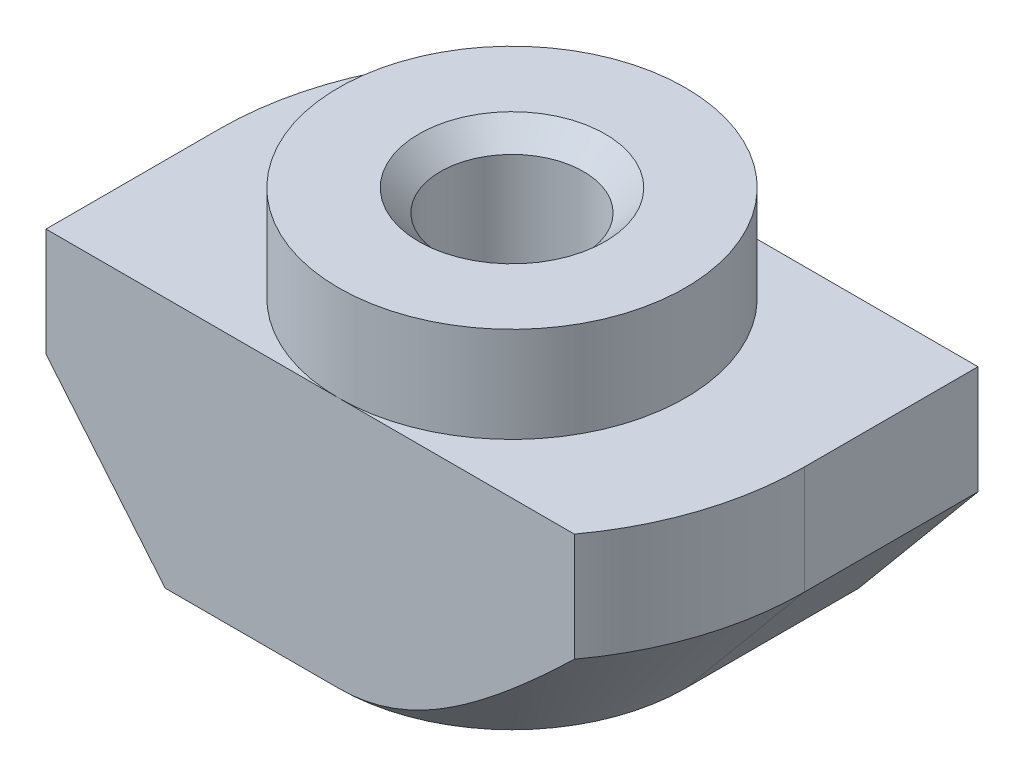
ISO-10303-21;
HEADER;
FILE_DESCRIPTION(('STEP AP214'),'2;1');
FILE_NAME('part.step','',(''),(''),'','','');
FILE_SCHEMA(('AUTOMOTIVE_DESIGN { 1 0 10303 214 1 1 1 1 }'));
ENDSEC;
DATA;
#1=APPLICATION_CONTEXT('core data for automotive mechanical design processes');
#2=APPLICATION_PROTOCOL_DEFINITION('international standard','automotive_design',2000,#1);
#3=PRODUCT_CONTEXT('',#1,'mechanical');
#4=PRODUCT('Part','Part','',(#3));
#5=PRODUCT_RELATED_PRODUCT_CATEGORY('part','',(#4));
#6=PRODUCT_DEFINITION_FORMATION('','',#4);
#7=PRODUCT_DEFINITION_CONTEXT('part definition',#1,'design');
#8=PRODUCT_DEFINITION('design','',#6,#7);
#9=PRODUCT_DEFINITION_SHAPE('','',#8);
#10=(LENGTH_UNIT() NAMED_UNIT(*) SI_UNIT(.MILLI.,.METRE.));
#11=(NAMED_UNIT(*) PLANE_ANGLE_UNIT() SI_UNIT($,.RADIAN.));
#12=(NAMED_UNIT(*) SI_UNIT($,.STERADIAN.) SOLID_ANGLE_UNIT());
#13=UNCERTAINTY_MEASURE_WITH_UNIT(LENGTH_MEASURE(1.E-05),#10,'distance_accuracy_value','');
#14=(GEOMETRIC_REPRESENTATION_CONTEXT(3) GLOBAL_UNCERTAINTY_ASSIGNED_CONTEXT((#13)) GLOBAL_UNIT_ASSIGNED_CONTEXT((#10,
#11,#12)) REPRESENTATION_CONTEXT('',''));
#15=CARTESIAN_POINT('',(0.,0.,0.));
#16=DIRECTION('',(0.,0.,1.));
#17=DIRECTION('',(1.,0.,0.));
#18=AXIS2_PLACEMENT_3D('',#15,#16,#17);
#19=CARTESIAN_POINT('',(-6.75,-2.2,4.));
#20=DIRECTION('',(1.,0.,0.));
#21=DIRECTION('',(0.,1.,0.));
#22=AXIS2_PLACEMENT_3D('',#19,#20,#21);
#23=PLANE('',#22);
#24=DIRECTION('',(0.,0.,-1.));
#25=VECTOR('',#24,1.);
#26=CARTESIAN_POINT('',(-6.75,-4.7,4.));
#27=LINE('',#26,#25);
#28=CARTESIAN_POINT('',(-6.75,-4.7,4.));
#29=VERTEX_POINT('',#28);
#30=CARTESIAN_POINT('',(-6.75,-4.7,0.));
#31=VERTEX_POINT('',#30);
#32=EDGE_CURVE('E205',#29,#31,#27,.T.);
#33=ORIENTED_EDGE('',*,*,#32,.F.);
#34=DIRECTION('',(0.,-1.,0.));
#35=VECTOR('',#34,1.);
#36=CARTESIAN_POINT('',(-6.75,-2.2,4.));
#37=LINE('',#36,#35);
#38=CARTESIAN_POINT('',(-6.75,-2.2,4.));
#39=VERTEX_POINT('',#38);
#40=EDGE_CURVE('E134',#39,#29,#37,.T.);
#41=ORIENTED_EDGE('',*,*,#40,.F.);
#42=DIRECTION('',(0.,0.,-1.));
#43=VECTOR('',#42,1.);
#44=CARTESIAN_POINT('',(-6.75,-2.2,4.));
#45=LINE('',#44,#43);
#46=CARTESIAN_POINT('',(-6.75,-2.2,0.));
#47=VERTEX_POINT('',#46);
#48=EDGE_CURVE('E12',#39,#47,#45,.T.);
#49=ORIENTED_EDGE('',*,*,#48,.T.);
#50=DIRECTION('',(0.,1.,0.));
#51=VECTOR('',#50,1.);
#52=CARTESIAN_POINT('',(-6.75,-8.,0.));
#53=LINE('',#52,#51);
#54=EDGE_CURVE('E206',#31,#47,#53,.T.);
#55=ORIENTED_EDGE('',*,*,#54,.F.);
#56=EDGE_LOOP('',(#33,#41,#49,#55));
#57=FACE_BOUND('',#56,.T.);
#58=ADVANCED_FACE('F38',(#57),#23,.F.);
#59=CARTESIAN_POINT('',(-6.75,-8.,4.));
#60=DIRECTION('',(0.,1.,0.));
#61=DIRECTION('',(0.,0.,1.));
#62=AXIS2_PLACEMENT_3D('',#59,#60,#61);
#63=PLANE('',#62);
#64=CARTESIAN_POINT('',(0.,-8.,0.));
#65=DIRECTION('',(0.,1.,0.));
#66=DIRECTION('',(0.,0.,1.));
#67=AXIS2_PLACEMENT_3D('',#64,#65,#66);
#68=CIRCLE('',#67,2.15);
#69=CARTESIAN_POINT('',(0.,-8.,2.15));
#70=VERTEX_POINT('',#69);
#71=EDGE_CURVE('E186',#70,#70,#68,.T.);
#72=ORIENTED_EDGE('',*,*,#71,.T.);
#73=EDGE_LOOP('',(#72));
#74=FACE_BOUND('',#73,.T.);
#75=DIRECTION('',(1.,0.,0.));
#76=VECTOR('',#75,1.);
#77=CARTESIAN_POINT('',(-6.75,-8.,4.));
#78=LINE('',#77,#76);
#79=CARTESIAN_POINT('',(-4.,-8.,4.));
#80=VERTEX_POINT('',#79);
#81=CARTESIAN_POINT('',(0.,-8.,4.));
#82=VERTEX_POINT('',#81);
#83=EDGE_CURVE('E132',#80,#82,#78,.T.);
#84=ORIENTED_EDGE('',*,*,#83,.F.);
#85=DIRECTION('',(0.,0.,-1.));
#86=VECTOR('',#85,1.);
#87=CARTESIAN_POINT('',(-4.,-8.,4.));
#88=LINE('',#87,#86);
#89=CARTESIAN_POINT('',(-4.,-8.,0.));
#90=VERTEX_POINT('',#89);
#91=EDGE_CURVE('E117',#80,#90,#88,.T.);
#92=ORIENTED_EDGE('',*,*,#91,.T.);
#93=CARTESIAN_POINT('',(0.,-8.,0.));
#94=DIRECTION('',(0.,-1.,0.));
#95=DIRECTION('',(-1.,0.,0.));
#96=AXIS2_PLACEMENT_3D('',#93,#94,#95);
#97=CIRCLE('',#96,4.);
#98=CARTESIAN_POINT('',(0.,-8.,-4.));
#99=VERTEX_POINT('',#98);
#100=EDGE_CURVE('E207',#90,#99,#97,.T.);
#101=ORIENTED_EDGE('',*,*,#100,.T.);
#102=DIRECTION('',(1.,0.,0.));
#103=VECTOR('',#102,1.);
#104=CARTESIAN_POINT('',(-6.75,-8.,-4.));
#105=LINE('',#104,#103);
#106=CARTESIAN_POINT('',(4.,-8.,-4.));
#107=VERTEX_POINT('',#106);
#108=EDGE_CURVE('E149',#99,#107,#105,.T.);
#109=ORIENTED_EDGE('',*,*,#108,.T.);
#110=DIRECTION('',(0.,0.,1.));
#111=VECTOR('',#110,1.);
#112=CARTESIAN_POINT('',(4.,-8.,-6.75));
#113=LINE('',#112,#111);
#114=CARTESIAN_POINT('',(4.,-8.,0.));
#115=VERTEX_POINT('',#114);
#116=EDGE_CURVE('E53',#107,#115,#113,.T.);
#117=ORIENTED_EDGE('',*,*,#116,.T.);
#118=CARTESIAN_POINT('',(0.,-8.,0.));
#119=DIRECTION('',(0.,-1.,0.));
#120=DIRECTION('',(1.,0.,0.));
#121=AXIS2_PLACEMENT_3D('',#118,#119,#120);
#122=CIRCLE('',#121,4.);
#123=EDGE_CURVE('E138',#115,#82,#122,.T.);
#124=ORIENTED_EDGE('',*,*,#123,.T.);
#125=EDGE_LOOP('',(#84,#92,#101,#109,#117,#124));
#126=FACE_BOUND('',#125,.T.);
#127=ADVANCED_FACE('F137',(#74,#126),#63,.F.);
#128=CARTESIAN_POINT('',(6.75,-2.2,4.));
#129=DIRECTION('',(-1.,0.,0.));
#130=DIRECTION('',(0.,-1.,0.));
#131=AXIS2_PLACEMENT_3D('',#128,#129,#130);
#132=PLANE('',#131);
#133=DIRECTION('',(0.,0.,1.));
#134=VECTOR('',#133,1.);
#135=CARTESIAN_POINT('',(6.75,-4.7,-6.75));
#136=LINE('',#135,#134);
#137=CARTESIAN_POINT('',(6.75,-4.7,-4.));
#138=VERTEX_POINT('',#137);
#139=CARTESIAN_POINT('',(6.75,-4.7,0.));
#140=VERTEX_POINT('',#139);
#141=EDGE_CURVE('E418',#138,#140,#136,.T.);
#142=ORIENTED_EDGE('',*,*,#141,.F.);
#143=DIRECTION('',(0.,1.,0.));
#144=VECTOR('',#143,1.);
#145=CARTESIAN_POINT('',(6.75,-2.2,-4.));
#146=LINE('',#145,#144);
#147=CARTESIAN_POINT('',(6.75,-2.2,-4.));
#148=VERTEX_POINT('',#147);
#149=EDGE_CURVE('E153',#138,#148,#146,.T.);
#150=ORIENTED_EDGE('',*,*,#149,.T.);
#151=DIRECTION('',(0.,0.,-1.));
#152=VECTOR('',#151,1.);
#153=CARTESIAN_POINT('',(6.75,-2.2,4.));
#154=LINE('',#153,#152);
#155=CARTESIAN_POINT('',(6.75,-2.2,0.));
#156=VERTEX_POINT('',#155);
#157=EDGE_CURVE('E46',#156,#148,#154,.T.);
#158=ORIENTED_EDGE('',*,*,#157,.F.);
#159=DIRECTION('',(0.,1.,0.));
#160=VECTOR('',#159,1.);
#161=CARTESIAN_POINT('',(6.75,-8.,0.));
#162=LINE('',#161,#160);
#163=EDGE_CURVE('E414',#140,#156,#162,.T.);
#164=ORIENTED_EDGE('',*,*,#163,.F.);
#165=EDGE_LOOP('',(#142,#150,#158,#164));
#166=FACE_BOUND('',#165,.T.);
#167=ADVANCED_FACE('F279',(#166),#132,.F.);
#168=CARTESIAN_POINT('',(0.,0.,4.));
#169=DIRECTION('',(0.,0.,-1.));
#170=DIRECTION('',(-1.,0.,0.));
#171=AXIS2_PLACEMENT_3D('',#168,#169,#170);
#172=PLANE('',#171);
#173=DIRECTION('',(-0.64018439966448,0.768221279597376,0.));
#174=VECTOR('',#173,1.);
#175=CARTESIAN_POINT('',(-4.,-8.,4.));
#176=LINE('',#175,#174);
#177=EDGE_CURVE('E120',#80,#29,#176,.T.);
#178=ORIENTED_EDGE('',*,*,#177,.F.);
#179=ORIENTED_EDGE('',*,*,#83,.T.);
#180=CARTESIAN_POINT('',(11.3671058523787,1.6604279833352,4.));
#181=CARTESIAN_POINT('',(11.0760860403435,1.33105236329668,4.));
#182=CARTESIAN_POINT('',(10.7844170425921,1.0022457486954,4.));
#183=CARTESIAN_POINT('',(10.1993231212537,0.346167668803112,4.));
#184=CARTESIAN_POINT('',(9.90589810454392,0.0188962865979481,4.));
#185=CARTESIAN_POINT('',(9.31636959174981,-0.634228413028052,4.));
#186=CARTESIAN_POINT('',(9.02026241673751,-0.960078413617772,4.));
#187=CARTESIAN_POINT('',(8.42520423771567,-1.60916385316204,4.));
#188=CARTESIAN_POINT('',(8.12625329733044,-1.93239935031355,4.));
#189=CARTESIAN_POINT('',(7.62113759930271,-2.4721099891261,4.));
#190=CARTESIAN_POINT('',(7.41599765243581,-2.68954364333778,4.));
#191=CARTESIAN_POINT('',(7.00354639223159,-3.12234172549854,4.));
#192=CARTESIAN_POINT('',(6.79623509747719,-3.3377061711262,4.));
#193=CARTESIAN_POINT('',(6.37905836666979,-3.76561209058286,4.));
#194=CARTESIAN_POINT('',(6.16919513057166,-3.97815570550829,4.));
#195=CARTESIAN_POINT('',(5.74601037812939,-4.39976961895935,4.));
#196=CARTESIAN_POINT('',(5.53268898786923,-4.60884004355697,4.));
#197=CARTESIAN_POINT('',(5.15124375070127,-4.97462048091292,4.));
#198=CARTESIAN_POINT('',(4.98403986804425,-5.13228814267081,4.));
#199=CARTESIAN_POINT('',(4.64631811321141,-5.44402840167018,4.));
#200=CARTESIAN_POINT('',(4.47580042417569,-5.598101196555,4.));
#201=CARTESIAN_POINT('',(4.13017207023597,-5.90188540217576,4.));
#202=CARTESIAN_POINT('',(3.95505126633798,-6.05158532538534,4.));
#203=CARTESIAN_POINT('',(3.59949530306292,-6.34453303438679,4.));
#204=CARTESIAN_POINT('',(3.41906102603611,-6.48778188155665,4.));
#205=CARTESIAN_POINT('',(3.08710238276612,-6.7382816415291,4.));
#206=CARTESIAN_POINT('',(2.9367791889699,-6.84711583647144,4.));
#207=CARTESIAN_POINT('',(2.63062968508205,-7.05697462965617,4.));
#208=CARTESIAN_POINT('',(2.47480119221121,-7.15799607845374,4.));
#209=CARTESIAN_POINT('',(2.15713415120621,-7.3489904492666,4.));
#210=CARTESIAN_POINT('',(1.99531682288903,-7.43899827290574,4.));
#211=CARTESIAN_POINT('',(1.66430471093152,-7.60421837809288,4.));
#212=CARTESIAN_POINT('',(1.49511815297165,-7.67944666473227,4.));
#213=CARTESIAN_POINT('',(1.22532028837003,-7.78104788986654,4.));
#214=CARTESIAN_POINT('',(1.1273143533449,-7.81434780581565,4.));
#215=CARTESIAN_POINT('',(0.929111702410566,-7.87355862683957,4.));
#216=CARTESIAN_POINT('',(0.828915970387746,-7.8994727797637,4.));
#217=CARTESIAN_POINT('',(0.626974776585255,-7.94285077714466,4.));
#218=CARTESIAN_POINT('',(0.525234247502404,-7.96033732003277,4.));
#219=CARTESIAN_POINT('',(0.320587377338076,-7.9861557277214,4.));
#220=CARTESIAN_POINT('',(0.217681101494288,-7.99448810227678,4.));
#221=CARTESIAN_POINT('',(0.0109646248512727,-8.00159180517583,4.));
#222=CARTESIAN_POINT('',(-0.0928474297287709,-8.00031009062098,4.));
#223=CARTESIAN_POINT('',(-0.299898814737338,-7.9881281506586,4.));
#224=CARTESIAN_POINT('',(-0.40313813276692,-7.97722771783069,4.));
#225=CARTESIAN_POINT('',(-0.608438421840278,-7.94633009665039,4.));
#226=CARTESIAN_POINT('',(-0.71049665003145,-7.92631491101996,4.));
#227=CARTESIAN_POINT('',(-0.912642818545191,-7.87808415322407,4.));
#228=CARTESIAN_POINT('',(-1.01273044558611,-7.84986728823619,4.));
#229=CARTESIAN_POINT('',(-1.26097022328073,-7.77010282363247,4.));
#230=CARTESIAN_POINT('',(-1.40765516117371,-7.71399045924579,4.));
#231=CARTESIAN_POINT('',(-1.69551109235078,-7.58908365745236,4.));
#232=CARTESIAN_POINT('',(-1.83667800442798,-7.52028004074414,4.));
#233=CARTESIAN_POINT('',(-2.11511367892286,-7.37234003071119,4.));
#234=CARTESIAN_POINT('',(-2.2523340884189,-7.29311364527057,4.));
#235=CARTESIAN_POINT('',(-2.52208605930552,-7.12722060395302,4.));
#236=CARTESIAN_POINT('',(-2.6546191958479,-7.04055648171835,4.));
#237=CARTESIAN_POINT('',(-2.95400047597727,-6.83527687212387,4.));
#238=CARTESIAN_POINT('',(-3.11952436318278,-6.7147399741869,4.));
#239=CARTESIAN_POINT('',(-3.44531861404335,-6.46672890623101,4.));
#240=CARTESIAN_POINT('',(-3.60558727407307,-6.33925252152669,4.));
#241=CARTESIAN_POINT('',(-3.9221474541375,-6.07893509202181,4.));
#242=CARTESIAN_POINT('',(-4.07843167821133,-5.94608521765208,4.));
#243=CARTESIAN_POINT('',(-4.38757291443555,-5.67645232979501,4.));
#244=CARTESIAN_POINT('',(-4.54042969785064,-5.53966905518858,4.));
#245=CARTESIAN_POINT('',(-4.83522877775952,-5.27046150562527,4.));
#246=CARTESIAN_POINT('',(-4.97731697077144,-5.1381965019456,4.));
#247=CARTESIAN_POINT('',(-5.25941894431438,-4.87146361855921,4.));
#248=CARTESIAN_POINT('',(-5.39943262931632,-4.73699563800422,4.));
#249=CARTESIAN_POINT('',(-5.67711404789033,-4.46686346687586,4.));
#250=CARTESIAN_POINT('',(-5.81478933960528,-4.33120702987574,4.));
#251=CARTESIAN_POINT('',(-6.08865443408717,-4.05843440191746,4.));
#252=CARTESIAN_POINT('',(-6.224844412109,-3.92131838703406,4.));
#253=CARTESIAN_POINT('',(-6.36042798333519,-3.78361139097708,4.));
#254=B_SPLINE_CURVE_WITH_KNOTS('',3,(#180,#181,#182,#183,#184,#185,#186,#187,#188,#189,#190,
#191,#192,#193,#194,#195,#196,#197,#198,#199,#200,#201,#202,#203,#204,#205,#206,#207,#208,#209,
#210,#211,#212,#213,#214,#215,#216,#217,#218,#219,#220,#221,#222,#223,#224,#225,#226,#227,#228,
#229,#230,#231,#232,#233,#234,#235,#236,#237,#238,#239,#240,#241,#242,#243,#244,#245,#246,#247,
#248,#249,#250,#251,#252,#253),.UNSPECIFIED.,.F.,.F.,(4,2,2,2,2,2,2,2,2,2,2,2,2,2,2,2,2,2,2,2,2,
2,2,2,2,2,2,2,2,2,2,2,2,2,2,2,4),(0.,1.31857462633975,2.63721980838195,3.95808596325466,
5.2789226352314,6.17570450954513,7.07247871524691,7.96852805964379,8.86454480731277,
9.55395925437611,10.2433357081569,10.9343845914659,11.6253193598719,12.1818961728885,
12.7386961940615,13.2936833492167,13.8480661428148,14.1583551805519,14.4685075590911,
14.7778198572062,15.0871149302236,15.398117697584,15.7091271716476,16.0207534213141,
16.3324288189748,16.8027542480267,17.2734211964924,17.7484574522495,18.223332525822,
18.8373538413049,19.4515722792289,20.066844614587,20.6821578895728,21.2644939095022,
21.846856662618,22.4266847622442,23.006443690165),.UNSPECIFIED.);
#255=CARTESIAN_POINT('',(5.43714079273289,-4.7,4.));
#256=VERTEX_POINT('',#255);
#257=EDGE_CURVE('E216',#256,#82,#254,.T.);
#258=ORIENTED_EDGE('',*,*,#257,.F.);
#259=DIRECTION('',(0.,1.,0.));
#260=VECTOR('',#259,1.);
#261=CARTESIAN_POINT('',(5.43714079273289,-8.,4.));
#262=LINE('',#261,#260);
#263=CARTESIAN_POINT('',(5.43714079273289,-2.2,4.));
#264=VERTEX_POINT('',#263);
#265=EDGE_CURVE('E413',#256,#264,#262,.T.);
#266=ORIENTED_EDGE('',*,*,#265,.T.);
#267=DIRECTION('',(-1.,0.,0.));
#268=VECTOR('',#267,1.);
#269=CARTESIAN_POINT('',(4.,-2.2,4.));
#270=LINE('',#269,#268);
#271=CARTESIAN_POINT('',(0.,-2.2,4.));
#272=VERTEX_POINT('',#271);
#273=EDGE_CURVE('E139',#264,#272,#270,.T.);
#274=ORIENTED_EDGE('',*,*,#273,.T.);
#275=DIRECTION('',(-1.,0.,0.));
#276=VECTOR('',#275,1.);
#277=CARTESIAN_POINT('',(-4.,-2.2,4.));
#278=LINE('',#277,#276);
#279=EDGE_CURVE('E142',#272,#39,#278,.T.);
#280=ORIENTED_EDGE('',*,*,#279,.T.);
#281=ORIENTED_EDGE('',*,*,#40,.T.);
#282=EDGE_LOOP('',(#178,#179,#258,#266,#274,#280,#281));
#283=FACE_BOUND('',#282,.T.);
#284=ADVANCED_FACE('F130',(#283),#172,.F.);
#285=CARTESIAN_POINT('',(0.,0.,-4.));
#286=DIRECTION('',(0.,0.,-1.));
#287=DIRECTION('',(-1.,0.,0.));
#288=AXIS2_PLACEMENT_3D('',#285,#286,#287);
#289=PLANE('',#288);
#290=ORIENTED_EDGE('',*,*,#108,.F.);
#291=CARTESIAN_POINT('',(6.36042798333519,-3.78361139097707,-4.));
#292=CARTESIAN_POINT('',(6.19096575336858,-3.95569840243713,-4.));
#293=CARTESIAN_POINT('',(6.02057434282416,-4.12688678135177,-4.));
#294=CARTESIAN_POINT('',(5.67733276321281,-4.46690600025116,-4.));
#295=CARTESIAN_POINT('',(5.50448170584883,-4.63573594250527,-4.));
#296=CARTESIAN_POINT('',(5.15343455302278,-4.972663262347,-4.));
#297=CARTESIAN_POINT('',(4.9751975969079,-5.14071821849171,-4.));
#298=CARTESIAN_POINT('',(4.6149498607722,-5.47268321242632,-4.));
#299=CARTESIAN_POINT('',(4.43293975985162,-5.63659398450987,-4.));
#300=CARTESIAN_POINT('',(4.06675827990445,-5.95652898831325,-4.));
#301=CARTESIAN_POINT('',(3.88265752383698,-6.11263353638464,-4.));
#302=CARTESIAN_POINT('',(3.50828453614381,-6.41749747866301,-4.));
#303=CARTESIAN_POINT('',(3.31800926609262,-6.56625316287942,-4.));
#304=CARTESIAN_POINT('',(2.93035124990496,-6.85259362520673,-4.));
#305=CARTESIAN_POINT('',(2.73300275139348,-6.99022387683537,-4.));
#306=CARTESIAN_POINT('',(2.42953473468976,-7.18489735123375,-4.));
#307=CARTESIAN_POINT('',(2.32717967179717,-7.24780404036723,-4.));
#308=CARTESIAN_POINT('',(2.11966414757884,-7.36879189976334,-4.));
#309=CARTESIAN_POINT('',(2.01450430910475,-7.4268741297905,-4.));
#310=CARTESIAN_POINT('',(1.80835156000338,-7.53336911111571,-4.));
#311=CARTESIAN_POINT('',(1.70756069861796,-7.58217066418254,-4.));
#312=CARTESIAN_POINT('',(1.50316245831686,-7.67352703006457,-4.));
#313=CARTESIAN_POINT('',(1.39955510653057,-7.7160819030247,-4.));
#314=CARTESIAN_POINT('',(1.18972908518557,-7.79360961328778,-4.));
#315=CARTESIAN_POINT('',(1.08351559358896,-7.82859631293787,-4.));
#316=CARTESIAN_POINT('',(0.868583618519514,-7.88973401493709,-4.));
#317=CARTESIAN_POINT('',(0.759866032508893,-7.91588813180793,-4.));
#318=CARTESIAN_POINT('',(0.538694027528681,-7.95846494602781,-4.));
#319=CARTESIAN_POINT('',(0.426207628128944,-7.9747242726588,-4.));
#320=CARTESIAN_POINT('',(0.200169904733209,-7.99589452771145,-4.));
#321=CARTESIAN_POINT('',(0.0866187330024983,-8.00080705463661,-4.));
#322=CARTESIAN_POINT('',(-0.14030246546195,-7.99897680276572,-4.));
#323=CARTESIAN_POINT('',(-0.253672564281047,-7.99224288233528,-4.));
#324=CARTESIAN_POINT('',(-0.479183052625283,-7.96756047116108,-4.));
#325=CARTESIAN_POINT('',(-0.591323194273916,-7.94960976064056,-4.));
#326=CARTESIAN_POINT('',(-0.828679638026792,-7.90034905554965,-4.));
#327=CARTESIAN_POINT('',(-0.953583231400814,-7.86754605043562,-4.));
#328=CARTESIAN_POINT('',(-1.19986914543705,-7.79073406538926,-4.));
#329=CARTESIAN_POINT('',(-1.3212503989237,-7.74672172800898,-4.));
#330=CARTESIAN_POINT('',(-1.56082541702524,-7.64930064968035,-4.));
#331=CARTESIAN_POINT('',(-1.67900070300678,-7.59584703461212,-4.));
#332=CARTESIAN_POINT('',(-1.91163789661902,-7.48153602858787,-4.));
#333=CARTESIAN_POINT('',(-2.02610074298846,-7.42068052807702,-4.));
#334=CARTESIAN_POINT('',(-2.24982698084,-7.29408545468892,-4.));
#335=CARTESIAN_POINT('',(-2.35914453198821,-7.2284408283964,-4.));
#336=CARTESIAN_POINT('',(-2.57488733972282,-7.09253769210792,-4.));
#337=CARTESIAN_POINT('',(-2.68131199183111,-7.02227822815051,-4.));
#338=CARTESIAN_POINT('',(-2.89169764431045,-6.87797184251119,-4.));
#339=CARTESIAN_POINT('',(-2.99565622808834,-6.80392141347488,-4.));
#340=CARTESIAN_POINT('',(-3.2013375457822,-6.65277039463402,-4.));
#341=CARTESIAN_POINT('',(-3.3030600621233,-6.57566951003837,-4.));
#342=CARTESIAN_POINT('',(-3.60604350367824,-6.34006161951297,-4.));
#343=CARTESIAN_POINT('',(-3.80436678812835,-6.17777759521849,-4.));
#344=CARTESIAN_POINT('',(-4.19495816162702,-5.8463449975692,-4.));
#345=CARTESIAN_POINT('',(-4.38722911257422,-5.67719975790317,-4.));
#346=CARTESIAN_POINT('',(-4.76932607132929,-5.33194003602518,-4.));
#347=CARTESIAN_POINT('',(-4.95910052151099,-5.15576868961153,-4.));
#348=CARTESIAN_POINT('',(-5.33502188706818,-4.79957417522254,-4.));
#349=CARTESIAN_POINT('',(-5.52116842133824,-4.61955060670181,-4.));
#350=CARTESIAN_POINT('',(-5.89016183920031,-4.25697547690541,-4.));
#351=CARTESIAN_POINT('',(-6.07301515093437,-4.07443044237156,-4.));
#352=CARTESIAN_POINT('',(-6.43641169237051,-3.7070540660433,-4.));
#353=CARTESIAN_POINT('',(-6.61695488536694,-3.52222268801255,-4.));
#354=CARTESIAN_POINT('',(-6.99538489166774,-3.13085659403494,-4.));
#355=CARTESIAN_POINT('',(-7.19305928569326,-2.92411671759019,-4.));
#356=CARTESIAN_POINT('',(-7.58653956245801,-2.50886514282632,-4.));
#357=CARTESIAN_POINT('',(-7.78234542570909,-2.3003534260703,-4.));
#358=CARTESIAN_POINT('',(-8.367762944238,-1.67239202502907,-4.));
#359=CARTESIAN_POINT('',(-8.7550896613572,-1.25081288986206,-4.));
#360=CARTESIAN_POINT('',(-9.51490357897524,-0.415499947766777,-4.));
#361=CARTESIAN_POINT('',(-9.88750555068452,-0.00187016028489452,-4.));
#362=CARTESIAN_POINT('',(-10.4440554129111,0.620367028404783,-4.));
#363=CARTESIAN_POINT('',(-10.6291035911556,0.827991694286216,-4.));
#364=CARTESIAN_POINT('',(-10.9985605428931,1.24380681047688,-4.));
#365=CARTESIAN_POINT('',(-11.1829693205407,1.45199725709403,-4.));
#366=CARTESIAN_POINT('',(-11.3671058523788,1.66042798333522,-4.));
#367=B_SPLINE_CURVE_WITH_KNOTS('',3,(#291,#292,#293,#294,#295,#296,#297,#298,#299,#300,#301,
#302,#303,#304,#305,#306,#307,#308,#309,#310,#311,#312,#313,#314,#315,#316,#317,#318,#319,#320,
#321,#322,#323,#324,#325,#326,#327,#328,#329,#330,#331,#332,#333,#334,#335,#336,#337,#338,#339,
#340,#341,#342,#343,#344,#345,#346,#347,#348,#349,#350,#351,#352,#353,#354,#355,#356,#357,#358,
#359,#360,#361,#362,#363,#364,#365,#366),.UNSPECIFIED.,.F.,.F.,(4,2,2,2,2,2,2,2,2,2,2,2,2,2,2,2,
2,2,2,2,2,2,2,2,2,2,2,2,2,2,2,2,2,2,2,2,2,4),(0.,0.724570694082745,1.44941006424093,
2.18427371550557,2.9190062331236,3.64298504327244,4.3673256871961,5.08853781395851,
5.44885986155676,5.8091025485538,6.14487928433326,6.48065278694036,6.8158059576366,
7.15084082381942,7.49126707240273,7.83164535981976,8.17176486708144,8.51195170453121,
8.89873227102634,9.28562882355322,9.67441635667138,10.0631048009477,10.445504788757,
10.8279840751224,11.2108238573614,11.5937007274213,12.3622116617607,13.1303535669006,
13.9071050075758,14.6839376093844,15.4590392555737,16.2341532021534,17.0922460992291,
17.9503479361577,19.667785634447,21.3378879891101,22.1722473665305,23.0066013122183),.UNSPECIFIED.);
#368=CARTESIAN_POINT('',(-5.43714079273289,-4.7,-4.));
#369=VERTEX_POINT('',#368);
#370=EDGE_CURVE('E224',#99,#369,#367,.T.);
#371=ORIENTED_EDGE('',*,*,#370,.T.);
#372=DIRECTION('',(0.,1.,0.));
#373=VECTOR('',#372,1.);
#374=CARTESIAN_POINT('',(-5.43714079273289,-8.,-4.));
#375=LINE('',#374,#373);
#376=CARTESIAN_POINT('',(-5.43714079273289,-2.2,-4.));
#377=VERTEX_POINT('',#376);
#378=EDGE_CURVE('E176',#369,#377,#375,.T.);
#379=ORIENTED_EDGE('',*,*,#378,.T.);
#380=DIRECTION('',(-1.,0.,0.));
#381=VECTOR('',#380,1.);
#382=CARTESIAN_POINT('',(-4.,-2.2,-4.));
#383=LINE('',#382,#381);
#384=CARTESIAN_POINT('',(0.,-2.2,-4.));
#385=VERTEX_POINT('',#384);
#386=EDGE_CURVE('E146',#385,#377,#383,.T.);
#387=ORIENTED_EDGE('',*,*,#386,.F.);
#388=DIRECTION('',(-1.,0.,0.));
#389=VECTOR('',#388,1.);
#390=CARTESIAN_POINT('',(4.,-2.2,-4.));
#391=LINE('',#390,#389);
#392=EDGE_CURVE('E155',#148,#385,#391,.T.);
#393=ORIENTED_EDGE('',*,*,#392,.F.);
#394=ORIENTED_EDGE('',*,*,#149,.F.);
#395=DIRECTION('',(-0.64018439966448,-0.768221279597376,0.));
#396=VECTOR('',#395,1.);
#397=CARTESIAN_POINT('',(6.29508196721311,-5.24590163934426,-4.));
#398=LINE('',#397,#396);
#399=EDGE_CURVE('E214',#138,#107,#398,.T.);
#400=ORIENTED_EDGE('',*,*,#399,.T.);
#401=EDGE_LOOP('',(#290,#371,#379,#387,#393,#394,#400));
#402=FACE_BOUND('',#401,.T.);
#403=ADVANCED_FACE('F173',(#402),#289,.T.);
#404=CARTESIAN_POINT('',(0.,-8.,0.));
#405=DIRECTION('',(0.,1.,0.));
#406=DIRECTION('',(-1.,0.,0.));
#407=AXIS2_PLACEMENT_3D('',#404,#405,#406);
#408=CYLINDRICAL_SURFACE('',#407,6.75);
#409=CARTESIAN_POINT('',(0.,-4.7,0.));
#410=DIRECTION('',(0.,-1.,0.));
#411=DIRECTION('',(-1.,0.,0.));
#412=AXIS2_PLACEMENT_3D('',#409,#410,#411);
#413=CIRCLE('',#412,6.75);
#414=EDGE_CURVE('E61',#31,#369,#413,.T.);
#415=ORIENTED_EDGE('',*,*,#414,.F.);
#416=ORIENTED_EDGE('',*,*,#54,.T.);
#417=CARTESIAN_POINT('',(0.,-2.2,0.));
#418=DIRECTION('',(0.,-1.,0.));
#419=DIRECTION('',(-1.,0.,0.));
#420=AXIS2_PLACEMENT_3D('',#417,#418,#419);
#421=CIRCLE('',#420,6.75);
#422=EDGE_CURVE('E202',#47,#377,#421,.T.);
#423=ORIENTED_EDGE('',*,*,#422,.T.);
#424=ORIENTED_EDGE('',*,*,#378,.F.);
#425=EDGE_LOOP('',(#415,#416,#423,#424));
#426=FACE_BOUND('',#425,.T.);
#427=ADVANCED_FACE('F247',(#426),#408,.T.);
#428=CARTESIAN_POINT('',(0.,-8.,0.));
#429=DIRECTION('',(0.,1.,0.));
#430=DIRECTION('',(-1.,0.,0.));
#431=AXIS2_PLACEMENT_3D('',#428,#429,#430);
#432=CYLINDRICAL_SURFACE('',#431,6.75);
#433=CARTESIAN_POINT('',(0.,-4.7,0.));
#434=DIRECTION('',(0.,-1.,0.));
#435=DIRECTION('',(1.,0.,0.));
#436=AXIS2_PLACEMENT_3D('',#433,#434,#435);
#437=CIRCLE('',#436,6.75);
#438=EDGE_CURVE('E212',#140,#256,#437,.T.);
#439=ORIENTED_EDGE('',*,*,#438,.F.);
#440=ORIENTED_EDGE('',*,*,#163,.T.);
#441=CARTESIAN_POINT('',(0.,-2.2,0.));
#442=DIRECTION('',(0.,-1.,0.));
#443=DIRECTION('',(1.,0.,0.));
#444=AXIS2_PLACEMENT_3D('',#441,#442,#443);
#445=CIRCLE('',#444,6.75);
#446=EDGE_CURVE('E167',#156,#264,#445,.T.);
#447=ORIENTED_EDGE('',*,*,#446,.T.);
#448=ORIENTED_EDGE('',*,*,#265,.F.);
#449=EDGE_LOOP('',(#439,#440,#447,#448));
#450=FACE_BOUND('',#449,.T.);
#451=ADVANCED_FACE('F250',(#450),#432,.T.);
#452=CARTESIAN_POINT('',(4.,0.,4.));
#453=DIRECTION('',(0.,-1.,0.));
#454=DIRECTION('',(0.,0.,-1.));
#455=AXIS2_PLACEMENT_3D('',#452,#453,#454);
#456=PLANE('',#455);
#457=CARTESIAN_POINT('',(0.,0.,0.));
#458=DIRECTION('',(0.,1.,0.));
#459=DIRECTION('',(0.,0.,1.));
#460=AXIS2_PLACEMENT_3D('',#457,#458,#459);
#461=CIRCLE('',#460,2.15);
#462=CARTESIAN_POINT('',(0.,0.,2.15));
#463=VERTEX_POINT('',#462);
#464=EDGE_CURVE('E189',#463,#463,#461,.T.);
#465=ORIENTED_EDGE('',*,*,#464,.F.);
#466=EDGE_LOOP('',(#465));
#467=FACE_BOUND('',#466,.T.);
#468=CARTESIAN_POINT('',(0.,0.,0.));
#469=DIRECTION('',(0.,1.,0.));
#470=DIRECTION('',(0.,0.,1.));
#471=AXIS2_PLACEMENT_3D('',#468,#469,#470);
#472=CIRCLE('',#471,4.);
#473=CARTESIAN_POINT('',(0.,0.,4.));
#474=VERTEX_POINT('',#473);
#475=EDGE_CURVE('E191',#474,#474,#472,.T.);
#476=ORIENTED_EDGE('',*,*,#475,.T.);
#477=EDGE_LOOP('',(#476));
#478=FACE_BOUND('',#477,.T.);
#479=ADVANCED_FACE('F254',(#467,#478),#456,.F.);
#480=CARTESIAN_POINT('',(-4.,-2.2,4.));
#481=DIRECTION('',(0.,-1.,0.));
#482=DIRECTION('',(1.,0.,0.));
#483=AXIS2_PLACEMENT_3D('',#480,#481,#482);
#484=PLANE('',#483);
#485=ORIENTED_EDGE('',*,*,#386,.T.);
#486=ORIENTED_EDGE('',*,*,#422,.F.);
#487=ORIENTED_EDGE('',*,*,#48,.F.);
#488=ORIENTED_EDGE('',*,*,#279,.F.);
#489=CARTESIAN_POINT('',(0.,-2.2,0.));
#490=DIRECTION('',(0.,-1.,0.));
#491=DIRECTION('',(1.,0.,0.));
#492=AXIS2_PLACEMENT_3D('',#489,#490,#491);
#493=CIRCLE('',#492,4.);
#494=EDGE_CURVE('E184',#385,#272,#493,.F.);
#495=ORIENTED_EDGE('',*,*,#494,.F.);
#496=EDGE_LOOP('',(#485,#486,#487,#488,#495));
#497=FACE_BOUND('',#496,.T.);
#498=ADVANCED_FACE('F40',(#497),#484,.F.);
#499=CARTESIAN_POINT('',(4.,-2.2,4.));
#500=DIRECTION('',(0.,-1.,0.));
#501=DIRECTION('',(1.,0.,0.));
#502=AXIS2_PLACEMENT_3D('',#499,#500,#501);
#503=PLANE('',#502);
#504=ORIENTED_EDGE('',*,*,#273,.F.);
#505=ORIENTED_EDGE('',*,*,#446,.F.);
#506=ORIENTED_EDGE('',*,*,#157,.T.);
#507=ORIENTED_EDGE('',*,*,#392,.T.);
#508=EDGE_CURVE('E182',#272,#385,#493,.F.);
#509=ORIENTED_EDGE('',*,*,#508,.F.);
#510=EDGE_LOOP('',(#504,#505,#506,#507,#509));
#511=FACE_BOUND('',#510,.T.);
#512=ADVANCED_FACE('F163',(#511),#503,.F.);
#513=CARTESIAN_POINT('',(0.,-7.5,0.));
#514=DIRECTION('',(0.,-1.,0.));
#515=DIRECTION('',(0.,0.,-1.));
#516=AXIS2_PLACEMENT_3D('',#513,#514,#515);
#517=CONICAL_SURFACE('',#516,1.65,0.785398163397447);
#518=ORIENTED_EDGE('',*,*,#71,.F.);
#519=EDGE_LOOP('',(#518));
#520=FACE_BOUND('',#519,.T.);
#521=CARTESIAN_POINT('',(0.,-7.5,0.));
#522=DIRECTION('',(0.,1.,0.));
#523=DIRECTION('',(0.,0.,1.));
#524=AXIS2_PLACEMENT_3D('',#521,#522,#523);
#525=CIRCLE('',#524,1.65);
#526=CARTESIAN_POINT('',(0.,-7.5,1.65));
#527=VERTEX_POINT('',#526);
#528=EDGE_CURVE('E150',#527,#527,#525,.T.);
#529=ORIENTED_EDGE('',*,*,#528,.T.);
#530=EDGE_LOOP('',(#529));
#531=FACE_BOUND('',#530,.T.);
#532=ADVANCED_FACE('F265',(#520,#531),#517,.F.);
#533=CARTESIAN_POINT('',(0.,0.,0.));
#534=DIRECTION('',(0.,1.,0.));
#535=DIRECTION('',(0.,0.,1.));
#536=AXIS2_PLACEMENT_3D('',#533,#534,#535);
#537=CYLINDRICAL_SURFACE('',#536,1.64999999999999);
#538=ORIENTED_EDGE('',*,*,#528,.F.);
#539=EDGE_LOOP('',(#538));
#540=FACE_BOUND('',#539,.T.);
#541=CARTESIAN_POINT('',(0.,-0.5,0.));
#542=DIRECTION('',(0.,1.,0.));
#543=DIRECTION('',(0.,0.,1.));
#544=AXIS2_PLACEMENT_3D('',#541,#542,#543);
#545=CIRCLE('',#544,1.64999999999999);
#546=CARTESIAN_POINT('',(0.,-0.5,1.64999999999999));
#547=VERTEX_POINT('',#546);
#548=EDGE_CURVE('E197',#547,#547,#545,.T.);
#549=ORIENTED_EDGE('',*,*,#548,.T.);
#550=EDGE_LOOP('',(#549));
#551=FACE_BOUND('',#550,.T.);
#552=ADVANCED_FACE('F262',(#540,#551),#537,.F.);
#553=CARTESIAN_POINT('',(0.,0.,0.));
#554=DIRECTION('',(0.,1.,0.));
#555=DIRECTION('',(0.,0.,1.));
#556=AXIS2_PLACEMENT_3D('',#553,#554,#555);
#557=CONICAL_SURFACE('',#556,2.15,0.785398163397457);
#558=ORIENTED_EDGE('',*,*,#548,.F.);
#559=EDGE_LOOP('',(#558));
#560=FACE_BOUND('',#559,.T.);
#561=ORIENTED_EDGE('',*,*,#464,.T.);
#562=EDGE_LOOP('',(#561));
#563=FACE_BOUND('',#562,.T.);
#564=ADVANCED_FACE('F258',(#560,#563),#557,.F.);
#565=CARTESIAN_POINT('',(0.,-18.0594837557847,0.));
#566=DIRECTION('',(0.,1.,0.));
#567=DIRECTION('',(0.,0.,1.));
#568=AXIS2_PLACEMENT_3D('',#565,#566,#567);
#569=CYLINDRICAL_SURFACE('',#568,4.);
#570=ORIENTED_EDGE('',*,*,#475,.F.);
#571=EDGE_LOOP('',(#570));
#572=FACE_BOUND('',#571,.T.);
#573=ORIENTED_EDGE('',*,*,#508,.T.);
#574=ORIENTED_EDGE('',*,*,#494,.T.);
#575=EDGE_LOOP('',(#573,#574));
#576=FACE_BOUND('',#575,.T.);
#577=ADVANCED_FACE('F183',(#572,#576),#569,.T.);
#578=CARTESIAN_POINT('',(4.,-8.,-6.75));
#579=DIRECTION('',(0.768221279597376,-0.64018439966448,0.));
#580=DIRECTION('',(0.64018439966448,0.768221279597376,0.));
#581=AXIS2_PLACEMENT_3D('',#578,#579,#580);
#582=PLANE('',#581);
#583=ORIENTED_EDGE('',*,*,#141,.T.);
#584=DIRECTION('',(0.64018439966448,0.768221279597376,0.));
#585=VECTOR('',#584,1.);
#586=CARTESIAN_POINT('',(4.,-8.,0.));
#587=LINE('',#586,#585);
#588=EDGE_CURVE('E420',#115,#140,#587,.T.);
#589=ORIENTED_EDGE('',*,*,#588,.F.);
#590=ORIENTED_EDGE('',*,*,#116,.F.);
#591=ORIENTED_EDGE('',*,*,#399,.F.);
#592=EDGE_LOOP('',(#583,#589,#590,#591));
#593=FACE_BOUND('',#592,.T.);
#594=ADVANCED_FACE('F238',(#593),#582,.T.);
#595=CARTESIAN_POINT('',(0.,-8.,0.));
#596=DIRECTION('',(0.,1.,0.));
#597=DIRECTION('',(0.,0.,1.));
#598=AXIS2_PLACEMENT_3D('',#595,#596,#597);
#599=CONICAL_SURFACE('',#598,4.,0.694738276196703);
#600=ORIENTED_EDGE('',*,*,#257,.T.);
#601=ORIENTED_EDGE('',*,*,#123,.F.);
#602=ORIENTED_EDGE('',*,*,#588,.T.);
#603=ORIENTED_EDGE('',*,*,#438,.T.);
#604=EDGE_LOOP('',(#600,#601,#602,#603));
#605=FACE_BOUND('',#604,.T.);
#606=ADVANCED_FACE('F234',(#605),#599,.T.);
#607=CARTESIAN_POINT('',(-4.,-8.,4.));
#608=DIRECTION('',(-0.768221279597376,-0.64018439966448,0.));
#609=DIRECTION('',(0.64018439966448,-0.768221279597376,0.));
#610=AXIS2_PLACEMENT_3D('',#607,#608,#609);
#611=PLANE('',#610);
#612=ORIENTED_EDGE('',*,*,#32,.T.);
#613=DIRECTION('',(-0.64018439966448,0.768221279597376,0.));
#614=VECTOR('',#613,1.);
#615=CARTESIAN_POINT('',(-4.,-8.,0.));
#616=LINE('',#615,#614);
#617=EDGE_CURVE('E122',#90,#31,#616,.T.);
#618=ORIENTED_EDGE('',*,*,#617,.F.);
#619=ORIENTED_EDGE('',*,*,#91,.F.);
#620=ORIENTED_EDGE('',*,*,#177,.T.);
#621=EDGE_LOOP('',(#612,#618,#619,#620));
#622=FACE_BOUND('',#621,.T.);
#623=ADVANCED_FACE('F119',(#622),#611,.T.);
#624=CARTESIAN_POINT('',(0.,-8.,0.));
#625=DIRECTION('',(0.,1.,0.));
#626=DIRECTION('',(0.,0.,1.));
#627=AXIS2_PLACEMENT_3D('',#624,#625,#626);
#628=CONICAL_SURFACE('',#627,4.,0.694738276196703);
#629=ORIENTED_EDGE('',*,*,#100,.F.);
#630=ORIENTED_EDGE('',*,*,#617,.T.);
#631=ORIENTED_EDGE('',*,*,#414,.T.);
#632=ORIENTED_EDGE('',*,*,#370,.F.);
#633=EDGE_LOOP('',(#629,#630,#631,#632));
#634=FACE_BOUND('',#633,.T.);
#635=ADVANCED_FACE('F240',(#634),#628,.T.);
#636=CLOSED_SHELL('',(#58,#127,#167,#284,#403,#427,#451,#479,#498,#512,#532,#552,#564,#577,#594,
#606,#623,#635));
#637=MANIFOLD_SOLID_BREP('B2',#636);
#638=ADVANCED_BREP_SHAPE_REPRESENTATION('',(#18,#637),#14);
#639=SHAPE_DEFINITION_REPRESENTATION(#9,#638);
ENDSEC;
END-ISO-10303-21;
